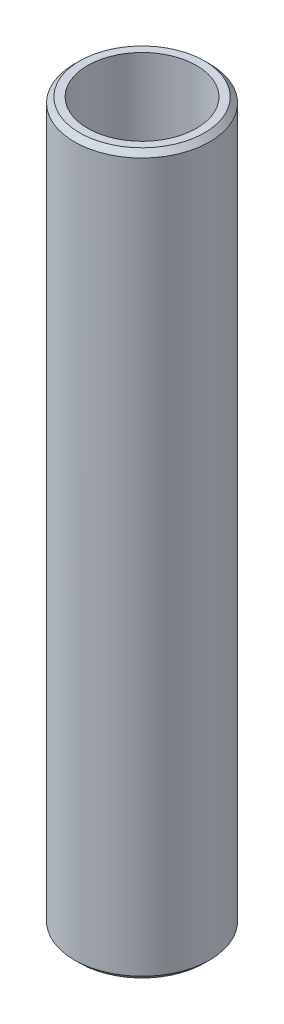
ISO-10303-21;
HEADER;
FILE_DESCRIPTION(('STEP AP214'),'2;1');
FILE_NAME('part.step','',(''),(''),'','','');
FILE_SCHEMA(('AUTOMOTIVE_DESIGN { 1 0 10303 214 1 1 1 1 }'));
ENDSEC;
DATA;
#1=APPLICATION_CONTEXT('core data for automotive mechanical design processes');
#2=APPLICATION_PROTOCOL_DEFINITION('international standard','automotive_design',2000,#1);
#3=PRODUCT_CONTEXT('',#1,'mechanical');
#4=PRODUCT('Part','Part','',(#3));
#5=PRODUCT_RELATED_PRODUCT_CATEGORY('part','',(#4));
#6=PRODUCT_DEFINITION_FORMATION('','',#4);
#7=PRODUCT_DEFINITION_CONTEXT('part definition',#1,'design');
#8=PRODUCT_DEFINITION('design','',#6,#7);
#9=PRODUCT_DEFINITION_SHAPE('','',#8);
#10=(LENGTH_UNIT() NAMED_UNIT(*) SI_UNIT(.MILLI.,.METRE.));
#11=(NAMED_UNIT(*) PLANE_ANGLE_UNIT() SI_UNIT($,.RADIAN.));
#12=(NAMED_UNIT(*) SI_UNIT($,.STERADIAN.) SOLID_ANGLE_UNIT());
#13=UNCERTAINTY_MEASURE_WITH_UNIT(LENGTH_MEASURE(1.E-05),#10,'distance_accuracy_value','');
#14=(GEOMETRIC_REPRESENTATION_CONTEXT(3) GLOBAL_UNCERTAINTY_ASSIGNED_CONTEXT((#13)) GLOBAL_UNIT_ASSIGNED_CONTEXT((#10,
#11,#12)) REPRESENTATION_CONTEXT('',''));
#15=CARTESIAN_POINT('',(0.,0.,0.));
#16=DIRECTION('',(0.,0.,1.));
#17=DIRECTION('',(1.,0.,0.));
#18=AXIS2_PLACEMENT_3D('',#15,#16,#17);
#19=CARTESIAN_POINT('',(0.,345.746391025883,0.));
#20=DIRECTION('',(0.,-1.,0.));
#21=DIRECTION('',(0.,0.,-1.));
#22=AXIS2_PLACEMENT_3D('',#19,#20,#21);
#23=CYLINDRICAL_SURFACE('',#22,32.5);
#24=CARTESIAN_POINT('',(0.,343.246958026156,0.));
#25=DIRECTION('',(0.,1.,0.));
#26=DIRECTION('',(0.,0.,1.));
#27=AXIS2_PLACEMENT_3D('',#24,#25,#26);
#28=CIRCLE('',#27,32.5);
#29=CARTESIAN_POINT('',(0.,343.246958026156,-32.5));
#30=VERTEX_POINT('',#29);
#31=EDGE_CURVE('E50',#30,#30,#28,.F.);
#32=CARTESIAN_POINT('',(0.,2.49943299972771,0.));
#33=DIRECTION('',(0.,1.,0.));
#34=DIRECTION('',(0.,0.,1.));
#35=AXIS2_PLACEMENT_3D('',#32,#33,#34);
#36=CIRCLE('',#35,32.5);
#37=CARTESIAN_POINT('',(0.,2.49943299972766,-32.5));
#38=VERTEX_POINT('',#37);
#39=EDGE_CURVE('E51',#38,#38,#36,.T.);
#40=CARTESIAN_POINT('',(0.,343.246958026156,-32.5));
#41=CARTESIAN_POINT('',(0.,339.697504640464,-32.5));
#42=CARTESIAN_POINT('',(0.,336.148051254772,-32.5));
#43=CARTESIAN_POINT('',(0.,329.049144483388,-32.5));
#44=CARTESIAN_POINT('',(0.,325.499691097696,-32.5));
#45=CARTESIAN_POINT('',(0.,318.400784326312,-32.5));
#46=CARTESIAN_POINT('',(0.,314.85133094062,-32.5));
#47=CARTESIAN_POINT('',(0.,307.752424169236,-32.5));
#48=CARTESIAN_POINT('',(0.,304.202970783544,-32.5));
#49=CARTESIAN_POINT('',(0.,297.10406401216,-32.5));
#50=CARTESIAN_POINT('',(0.,293.554610626468,-32.5));
#51=CARTESIAN_POINT('',(0.,286.455703855084,-32.5));
#52=CARTESIAN_POINT('',(0.,282.906250469392,-32.5));
#53=CARTESIAN_POINT('',(0.,275.807343698008,-32.5));
#54=CARTESIAN_POINT('',(0.,272.257890312316,-32.5));
#55=CARTESIAN_POINT('',(0.,265.158983540932,-32.5));
#56=CARTESIAN_POINT('',(0.,261.609530155241,-32.5));
#57=CARTESIAN_POINT('',(0.,254.510623383857,-32.5));
#58=CARTESIAN_POINT('',(0.,250.961169998165,-32.5));
#59=CARTESIAN_POINT('',(0.,243.862263226781,-32.5));
#60=CARTESIAN_POINT('',(0.,240.312809841089,-32.5));
#61=CARTESIAN_POINT('',(0.,233.213903069705,-32.5));
#62=CARTESIAN_POINT('',(0.,229.664449684013,-32.5));
#63=CARTESIAN_POINT('',(0.,222.565542912629,-32.5));
#64=CARTESIAN_POINT('',(0.,219.016089526937,-32.5));
#65=CARTESIAN_POINT('',(0.,211.917182755553,-32.5));
#66=CARTESIAN_POINT('',(0.,208.367729369861,-32.5));
#67=CARTESIAN_POINT('',(0.,201.268822598477,-32.5));
#68=CARTESIAN_POINT('',(0.,197.719369212785,-32.5));
#69=CARTESIAN_POINT('',(0.,190.620462441401,-32.5));
#70=CARTESIAN_POINT('',(0.,187.071009055709,-32.5));
#71=CARTESIAN_POINT('',(0.,179.972102284326,-32.5));
#72=CARTESIAN_POINT('',(0.,176.422648898634,-32.5));
#73=CARTESIAN_POINT('',(0.,169.32374212725,-32.5));
#74=CARTESIAN_POINT('',(0.,165.774288741558,-32.5));
#75=CARTESIAN_POINT('',(0.,158.675381970174,-32.5));
#76=CARTESIAN_POINT('',(0.,155.125928584482,-32.5));
#77=CARTESIAN_POINT('',(0.,148.027021813098,-32.5));
#78=CARTESIAN_POINT('',(0.,144.477568427406,-32.5));
#79=CARTESIAN_POINT('',(0.,137.378661656022,-32.5));
#80=CARTESIAN_POINT('',(0.,133.82920827033,-32.5));
#81=CARTESIAN_POINT('',(0.,126.730301498946,-32.5));
#82=CARTESIAN_POINT('',(0.,123.180848113254,-32.5));
#83=CARTESIAN_POINT('',(0.,116.08194134187,-32.5));
#84=CARTESIAN_POINT('',(0.,112.532487956178,-32.5));
#85=CARTESIAN_POINT('',(0.,105.433581184794,-32.5));
#86=CARTESIAN_POINT('',(0.,101.884127799102,-32.5));
#87=CARTESIAN_POINT('',(0.,94.7852210277186,-32.5));
#88=CARTESIAN_POINT('',(0.,91.2357676420266,-32.5));
#89=CARTESIAN_POINT('',(0.,84.1368608706427,-32.5));
#90=CARTESIAN_POINT('',(0.,80.5874074849507,-32.5));
#91=CARTESIAN_POINT('',(0.,73.4885007135668,-32.5));
#92=CARTESIAN_POINT('',(0.,69.9390473278749,-32.5));
#93=CARTESIAN_POINT('',(0.,62.840140556491,-32.5));
#94=CARTESIAN_POINT('',(0.,59.290687170799,-32.5));
#95=CARTESIAN_POINT('',(0.,52.1917803994151,-32.5));
#96=CARTESIAN_POINT('',(0.,48.6423270137231,-32.5));
#97=CARTESIAN_POINT('',(0.,41.5434202423392,-32.5));
#98=CARTESIAN_POINT('',(0.,37.9939668566472,-32.5));
#99=CARTESIAN_POINT('',(0.,30.8950600852633,-32.5));
#100=CARTESIAN_POINT('',(0.,27.3456066995714,-32.5));
#101=CARTESIAN_POINT('',(0.,20.2466999281875,-32.5));
#102=CARTESIAN_POINT('',(0.,16.6972465424955,-32.5));
#103=CARTESIAN_POINT('',(0.,9.59833977111158,-32.5));
#104=CARTESIAN_POINT('',(0.,6.04888638541962,-32.5));
#105=CARTESIAN_POINT('',(0.,2.49943299972766,-32.5));
#106=B_SPLINE_CURVE_WITH_KNOTS('',3,(#40,#41,#42,#43,#44,#45,#46,#47,#48,#49,#50,#51,#52,#53,
#54,#55,#56,#57,#58,#59,#60,#61,#62,#63,#64,#65,#66,#67,#68,#69,#70,#71,#72,#73,#74,#75,#76,#77,
#78,#79,#80,#81,#82,#83,#84,#85,#86,#87,#88,#89,#90,#91,#92,#93,#94,#95,#96,#97,#98,#99,#100,
#101,#102,#103,#104,#105),.UNSPECIFIED.,.F.,.F.,(4,2,2,2,2,2,2,2,2,2,2,2,2,2,2,2,2,2,2,2,2,2,2,
2,2,2,2,2,2,2,2,2,4),(0.,10.6483601570758,21.2967203141517,31.9450804712276,42.5934406283034,
53.2418007853793,63.8901609424552,74.5385210995311,85.186881256607,95.8352414136828,
106.483601570759,117.131961727835,127.78032188491,138.428682041986,149.077042199062,
159.725402356138,170.373762513214,181.02212267029,191.670482827366,202.318842984442,
212.967203141517,223.615563298593,234.263923455669,244.912283612745,255.560643769821,
266.209003926897,276.857364083973,287.505724241048,298.154084398124,308.8024445552,
319.450804712276,330.099164869352,340.747525026428),.UNSPECIFIED.);
#107=EDGE_CURVE('BSEAM39',#30,#38,#106,.T.);
#108=ORIENTED_EDGE('',*,*,#31,.T.);
#109=ORIENTED_EDGE('',*,*,#39,.T.);
#110=ORIENTED_EDGE('',*,*,#107,.T.);
#111=ORIENTED_EDGE('',*,*,#107,.F.);
#112=EDGE_LOOP('',(#108,#110,#109,#111));
#113=FACE_BOUND('',#112,.T.);
#114=ADVANCED_FACE('F39',(#113),#23,.T.);
#115=CARTESIAN_POINT('',(0.,345.746391025883,0.));
#116=DIRECTION('',(0.,1.,0.));
#117=DIRECTION('',(0.,0.,1.));
#118=AXIS2_PLACEMENT_3D('',#115,#116,#117);
#119=PLANE('',#118);
#120=CARTESIAN_POINT('',(0.,345.746391025883,0.));
#121=DIRECTION('',(0.,1.,0.));
#122=DIRECTION('',(0.,0.,1.));
#123=AXIS2_PLACEMENT_3D('',#120,#121,#122);
#124=CIRCLE('',#123,30.0005670002728);
#125=CARTESIAN_POINT('',(0.,345.746391025883,-30.0005670002728));
#126=VERTEX_POINT('',#125);
#127=EDGE_CURVE('E54',#126,#126,#124,.T.);
#128=ORIENTED_EDGE('',*,*,#127,.T.);
#129=EDGE_LOOP('',(#128));
#130=FACE_BOUND('',#129,.T.);
#131=CARTESIAN_POINT('',(0.,345.746391025883,0.));
#132=DIRECTION('',(0.,1.,0.));
#133=DIRECTION('',(0.,0.,1.));
#134=AXIS2_PLACEMENT_3D('',#131,#132,#133);
#135=CIRCLE('',#134,26.1776362664108);
#136=CARTESIAN_POINT('',(0.,345.746391025883,-26.1776362664108));
#137=VERTEX_POINT('',#136);
#138=EDGE_CURVE('E58',#137,#137,#135,.T.);
#139=ORIENTED_EDGE('',*,*,#138,.F.);
#140=EDGE_LOOP('',(#139));
#141=FACE_BOUND('',#140,.T.);
#142=ADVANCED_FACE('F69',(#130,#141),#119,.T.);
#143=CARTESIAN_POINT('',(0.,0.,0.));
#144=DIRECTION('',(0.,1.,0.));
#145=DIRECTION('',(0.,0.,1.));
#146=AXIS2_PLACEMENT_3D('',#143,#144,#145);
#147=PLANE('',#146);
#148=CARTESIAN_POINT('',(0.,0.,0.));
#149=DIRECTION('',(0.,1.,0.));
#150=DIRECTION('',(0.,0.,1.));
#151=AXIS2_PLACEMENT_3D('',#148,#149,#150);
#152=CIRCLE('',#151,30.0005670002723);
#153=CARTESIAN_POINT('',(0.,0.,30.0005670002723));
#154=VERTEX_POINT('',#153);
#155=EDGE_CURVE('E10',#154,#154,#152,.F.);
#156=ORIENTED_EDGE('',*,*,#155,.T.);
#157=EDGE_LOOP('',(#156));
#158=FACE_BOUND('',#157,.T.);
#159=CARTESIAN_POINT('',(0.,0.,0.));
#160=DIRECTION('',(0.,1.,0.));
#161=DIRECTION('',(0.,0.,1.));
#162=AXIS2_PLACEMENT_3D('',#159,#160,#161);
#163=CIRCLE('',#162,26.1776362664108);
#164=CARTESIAN_POINT('',(0.,0.,-26.1776362664108));
#165=VERTEX_POINT('',#164);
#166=EDGE_CURVE('E63',#165,#165,#163,.T.);
#167=ORIENTED_EDGE('',*,*,#166,.T.);
#168=EDGE_LOOP('',(#167));
#169=FACE_BOUND('',#168,.T.);
#170=ADVANCED_FACE('F75',(#158,#169),#147,.F.);
#171=CARTESIAN_POINT('',(0.,345.746391025883,0.));
#172=DIRECTION('',(0.,-1.,0.));
#173=DIRECTION('',(0.,0.,-1.));
#174=AXIS2_PLACEMENT_3D('',#171,#172,#173);
#175=CYLINDRICAL_SURFACE('',#174,26.1776362664108);
#176=CARTESIAN_POINT('',(0.,345.746391025883,-26.1776362664108));
#177=CARTESIAN_POINT('',(0.,342.144866119363,-26.1776362664108));
#178=CARTESIAN_POINT('',(0.,338.543341212844,-26.1776362664108));
#179=CARTESIAN_POINT('',(0.,331.340291399804,-26.1776362664108));
#180=CARTESIAN_POINT('',(0.,327.738766493285,-26.1776362664108));
#181=CARTESIAN_POINT('',(0.,320.535716680246,-26.1776362664108));
#182=CARTESIAN_POINT('',(0.,316.934191773726,-26.1776362664108));
#183=CARTESIAN_POINT('',(0.,309.731141960687,-26.1776362664108));
#184=CARTESIAN_POINT('',(0.,306.129617054167,-26.1776362664108));
#185=CARTESIAN_POINT('',(0.,298.926567241128,-26.1776362664108));
#186=CARTESIAN_POINT('',(0.,295.325042334608,-26.1776362664108));
#187=CARTESIAN_POINT('',(0.,288.121992521569,-26.1776362664108));
#188=CARTESIAN_POINT('',(0.,284.520467615049,-26.1776362664108));
#189=CARTESIAN_POINT('',(0.,277.31741780201,-26.1776362664108));
#190=CARTESIAN_POINT('',(0.,273.715892895491,-26.1776362664108));
#191=CARTESIAN_POINT('',(0.,266.512843082451,-26.1776362664108));
#192=CARTESIAN_POINT('',(0.,262.911318175932,-26.1776362664108));
#193=CARTESIAN_POINT('',(0.,255.708268362893,-26.1776362664108));
#194=CARTESIAN_POINT('',(0.,252.106743456373,-26.1776362664108));
#195=CARTESIAN_POINT('',(0.,244.903693643334,-26.1776362664108));
#196=CARTESIAN_POINT('',(0.,241.302168736814,-26.1776362664108));
#197=CARTESIAN_POINT('',(0.,234.099118923775,-26.1776362664108));
#198=CARTESIAN_POINT('',(0.,230.497594017255,-26.1776362664108));
#199=CARTESIAN_POINT('',(0.,223.294544204216,-26.1776362664108));
#200=CARTESIAN_POINT('',(0.,219.693019297696,-26.1776362664108));
#201=CARTESIAN_POINT('',(0.,212.489969484657,-26.1776362664108));
#202=CARTESIAN_POINT('',(0.,208.888444578138,-26.1776362664108));
#203=CARTESIAN_POINT('',(0.,201.685394765098,-26.1776362664108));
#204=CARTESIAN_POINT('',(0.,198.083869858579,-26.1776362664108));
#205=CARTESIAN_POINT('',(0.,190.880820045539,-26.1776362664108));
#206=CARTESIAN_POINT('',(0.,187.27929513902,-26.1776362664108));
#207=CARTESIAN_POINT('',(0.,180.076245325981,-26.1776362664108));
#208=CARTESIAN_POINT('',(0.,176.474720419461,-26.1776362664108));
#209=CARTESIAN_POINT('',(0.,169.271670606422,-26.1776362664108));
#210=CARTESIAN_POINT('',(0.,165.670145699902,-26.1776362664108));
#211=CARTESIAN_POINT('',(0.,158.467095886863,-26.1776362664108));
#212=CARTESIAN_POINT('',(0.,154.865570980343,-26.1776362664108));
#213=CARTESIAN_POINT('',(0.,147.662521167304,-26.1776362664108));
#214=CARTESIAN_POINT('',(0.,144.060996260784,-26.1776362664108));
#215=CARTESIAN_POINT('',(0.,136.857946447745,-26.1776362664108));
#216=CARTESIAN_POINT('',(0.,133.256421541226,-26.1776362664108));
#217=CARTESIAN_POINT('',(0.,126.053371728186,-26.1776362664108));
#218=CARTESIAN_POINT('',(0.,122.451846821667,-26.1776362664108));
#219=CARTESIAN_POINT('',(0.,115.248797008628,-26.1776362664108));
#220=CARTESIAN_POINT('',(0.,111.647272102108,-26.1776362664108));
#221=CARTESIAN_POINT('',(0.,104.444222289069,-26.1776362664108));
#222=CARTESIAN_POINT('',(0.,100.842697382549,-26.1776362664108));
#223=CARTESIAN_POINT('',(0.,93.6396475695099,-26.1776362664108));
#224=CARTESIAN_POINT('',(0.,90.0381226629903,-26.1776362664108));
#225=CARTESIAN_POINT('',(0.,82.8350728499511,-26.1776362664108));
#226=CARTESIAN_POINT('',(0.,79.2335479434315,-26.1776362664108));
#227=CARTESIAN_POINT('',(0.,72.0304981303922,-26.1776362664108));
#228=CARTESIAN_POINT('',(0.,68.4289732238726,-26.1776362664108));
#229=CARTESIAN_POINT('',(0.,61.2259234108334,-26.1776362664108));
#230=CARTESIAN_POINT('',(0.,57.6243985043138,-26.1776362664108));
#231=CARTESIAN_POINT('',(0.,50.4213486912746,-26.1776362664108));
#232=CARTESIAN_POINT('',(0.,46.819823784755,-26.1776362664108));
#233=CARTESIAN_POINT('',(0.,39.6167739717157,-26.1776362664108));
#234=CARTESIAN_POINT('',(0.,36.0152490651961,-26.1776362664108));
#235=CARTESIAN_POINT('',(0.,28.8121992521569,-26.1776362664108));
#236=CARTESIAN_POINT('',(0.,25.2106743456373,-26.1776362664108));
#237=CARTESIAN_POINT('',(0.,18.0076245325981,-26.1776362664108));
#238=CARTESIAN_POINT('',(0.,14.4060996260785,-26.1776362664108));
#239=CARTESIAN_POINT('',(0.,7.20304981303924,-26.1776362664108));
#240=CARTESIAN_POINT('',(0.,3.60152490651962,-26.1776362664108));
#241=CARTESIAN_POINT('',(0.,0.,-26.1776362664108));
#242=B_SPLINE_CURVE_WITH_KNOTS('',3,(#176,#177,#178,#179,#180,#181,#182,#183,#184,#185,#186,
#187,#188,#189,#190,#191,#192,#193,#194,#195,#196,#197,#198,#199,#200,#201,#202,#203,#204,#205,
#206,#207,#208,#209,#210,#211,#212,#213,#214,#215,#216,#217,#218,#219,#220,#221,#222,#223,#224,
#225,#226,#227,#228,#229,#230,#231,#232,#233,#234,#235,#236,#237,#238,#239,#240,#241),
.UNSPECIFIED.,.F.,.F.,(4,2,2,2,2,2,2,2,2,2,2,2,2,2,2,2,2,2,2,2,2,2,2,2,2,2,2,2,2,2,2,2,4),(0.,
10.8045747195589,21.6091494391177,32.4137241586766,43.2182988782354,54.0228735977942,
64.827448317353,75.6320230369119,86.4365977564707,97.2411724760296,108.045747195588,
118.850321915147,129.654896634706,140.459471354265,151.264046073824,162.068620793383,
172.873195512941,183.6777702325,194.482344952059,205.286919671618,216.091494391177,
226.896069110736,237.700643830294,248.505218549853,259.309793269412,270.114367988971,
280.91894270853,291.723517428089,302.528092147647,313.332666867206,324.137241586765,
334.941816306324,345.746391025883),.UNSPECIFIED.);
#243=EDGE_CURVE('BSEAM70',#137,#165,#242,.T.);
#244=ORIENTED_EDGE('',*,*,#138,.T.);
#245=ORIENTED_EDGE('',*,*,#166,.F.);
#246=ORIENTED_EDGE('',*,*,#243,.T.);
#247=ORIENTED_EDGE('',*,*,#243,.F.);
#248=EDGE_LOOP('',(#244,#246,#245,#247));
#249=FACE_BOUND('',#248,.T.);
#250=ADVANCED_FACE('F70',(#249),#175,.F.);
#251=CARTESIAN_POINT('',(0.,345.746391025883,0.));
#252=DIRECTION('',(0.,-1.,0.));
#253=DIRECTION('',(0.,0.,-1.));
#254=AXIS2_PLACEMENT_3D('',#251,#252,#253);
#255=CONICAL_SURFACE('',#254,30.0005670002728,0.785398163397444);
#256=CARTESIAN_POINT('',(0.,343.246958026156,-32.5));
#257=CARTESIAN_POINT('',(0.,343.272993786569,-32.4739642395862));
#258=CARTESIAN_POINT('',(0.,343.299029546983,-32.4479284791724));
#259=CARTESIAN_POINT('',(0.,343.351101067811,-32.3958569583447));
#260=CARTESIAN_POINT('',(0.,343.377136828225,-32.3698211979309));
#261=CARTESIAN_POINT('',(0.,343.429208349052,-32.3177496771033));
#262=CARTESIAN_POINT('',(0.,343.455244109466,-32.2917139166894));
#263=CARTESIAN_POINT('',(0.,343.507315630294,-32.2396423958618));
#264=CARTESIAN_POINT('',(0.,343.533351390708,-32.213606635448));
#265=CARTESIAN_POINT('',(0.,343.585422911535,-32.1615351146203));
#266=CARTESIAN_POINT('',(0.,343.611458671949,-32.1354993542065));
#267=CARTESIAN_POINT('',(0.,343.663530192777,-32.0834278333788));
#268=CARTESIAN_POINT('',(0.,343.689565953191,-32.057392072965));
#269=CARTESIAN_POINT('',(0.,343.741637474018,-32.0053205521373));
#270=CARTESIAN_POINT('',(0.,343.767673234432,-31.9792847917235));
#271=CARTESIAN_POINT('',(0.,343.81974475526,-31.9272132708959));
#272=CARTESIAN_POINT('',(0.,343.845780515674,-31.9011775104821));
#273=CARTESIAN_POINT('',(0.,343.897852036501,-31.8491059896544));
#274=CARTESIAN_POINT('',(0.,343.923887796915,-31.8230702292406));
#275=CARTESIAN_POINT('',(0.,343.975959317743,-31.7709987084129));
#276=CARTESIAN_POINT('',(0.,344.001995078156,-31.7449629479991));
#277=CARTESIAN_POINT('',(0.,344.054066598984,-31.6928914271714));
#278=CARTESIAN_POINT('',(0.,344.080102359398,-31.6668556667576));
#279=CARTESIAN_POINT('',(0.,344.132173880226,-31.61478414593));
#280=CARTESIAN_POINT('',(0.,344.158209640639,-31.5887483855161));
#281=CARTESIAN_POINT('',(0.,344.210281161467,-31.5366768646885));
#282=CARTESIAN_POINT('',(0.,344.236316921881,-31.5106411042747));
#283=CARTESIAN_POINT('',(0.,344.288388442709,-31.458569583447));
#284=CARTESIAN_POINT('',(0.,344.314424203122,-31.4325338230332));
#285=CARTESIAN_POINT('',(0.,344.36649572395,-31.3804623022055));
#286=CARTESIAN_POINT('',(0.,344.392531484364,-31.3544265417917));
#287=CARTESIAN_POINT('',(0.,344.444603005192,-31.3023550209641));
#288=CARTESIAN_POINT('',(0.,344.470638765605,-31.2763192605502));
#289=CARTESIAN_POINT('',(0.,344.522710286433,-31.2242477397226));
#290=CARTESIAN_POINT('',(0.,344.548746046847,-31.1982119793088));
#291=CARTESIAN_POINT('',(0.,344.600817567674,-31.1461404584811));
#292=CARTESIAN_POINT('',(0.,344.626853328088,-31.1201046980673));
#293=CARTESIAN_POINT('',(0.,344.678924848916,-31.0680331772396));
#294=CARTESIAN_POINT('',(0.,344.70496060933,-31.0419974168258));
#295=CARTESIAN_POINT('',(0.,344.757032130157,-30.9899258959981));
#296=CARTESIAN_POINT('',(0.,344.783067890571,-30.9638901355843));
#297=CARTESIAN_POINT('',(0.,344.835139411399,-30.9118186147567));
#298=CARTESIAN_POINT('',(0.,344.861175171813,-30.8857828543428));
#299=CARTESIAN_POINT('',(0.,344.91324669264,-30.8337113335152));
#300=CARTESIAN_POINT('',(0.,344.939282453054,-30.8076755731014));
#301=CARTESIAN_POINT('',(0.,344.991353973882,-30.7556040522737));
#302=CARTESIAN_POINT('',(0.,345.017389734296,-30.7295682918599));
#303=CARTESIAN_POINT('',(0.,345.069461255123,-30.6774967710322));
#304=CARTESIAN_POINT('',(0.,345.095497015537,-30.6514610106184));
#305=CARTESIAN_POINT('',(0.,345.147568536365,-30.5993894897908));
#306=CARTESIAN_POINT('',(0.,345.173604296779,-30.5733537293769));
#307=CARTESIAN_POINT('',(0.,345.225675817606,-30.5212822085493));
#308=CARTESIAN_POINT('',(0.,345.25171157802,-30.4952464481355));
#309=CARTESIAN_POINT('',(0.,345.303783098848,-30.4431749273078));
#310=CARTESIAN_POINT('',(0.,345.329818859262,-30.417139166894));
#311=CARTESIAN_POINT('',(0.,345.381890380089,-30.3650676460663));
#312=CARTESIAN_POINT('',(0.,345.407926140503,-30.3390318856525));
#313=CARTESIAN_POINT('',(0.,345.459997661331,-30.2869603648249));
#314=CARTESIAN_POINT('',(0.,345.486033421745,-30.260924604411));
#315=CARTESIAN_POINT('',(0.,345.538104942572,-30.2088530835834));
#316=CARTESIAN_POINT('',(0.,345.564140702986,-30.1828173231696));
#317=CARTESIAN_POINT('',(0.,345.616212223814,-30.1307458023419));
#318=CARTESIAN_POINT('',(0.,345.642247984227,-30.1047100419281));
#319=CARTESIAN_POINT('',(0.,345.694319505055,-30.0526385211004));
#320=CARTESIAN_POINT('',(0.,345.720355265469,-30.0266027606866));
#321=CARTESIAN_POINT('',(0.,345.746391025883,-30.0005670002728));
#322=B_SPLINE_CURVE_WITH_KNOTS('',3,(#256,#257,#258,#259,#260,#261,#262,#263,#264,#265,#266,
#267,#268,#269,#270,#271,#272,#273,#274,#275,#276,#277,#278,#279,#280,#281,#282,#283,#284,#285,
#286,#287,#288,#289,#290,#291,#292,#293,#294,#295,#296,#297,#298,#299,#300,#301,#302,#303,#304,
#305,#306,#307,#308,#309,#310,#311,#312,#313,#314,#315,#316,#317,#318,#319,#320,#321),
.UNSPECIFIED.,.F.,.F.,(4,2,2,2,2,2,2,2,2,2,2,2,2,2,2,2,2,2,2,2,2,2,2,2,2,2,2,2,2,2,2,2,4),(0.,
0.110460376451819,0.220920752903598,0.331381129355377,0.441841505807156,0.552301882258941,
0.66276225871072,0.773222635162538,0.883683011614318,0.994143388066097,1.10460376451788,
1.21506414096966,1.32552451742144,1.43598489387326,1.54644527032504,1.65690564677682,
1.7673660232286,1.87782639968038,1.98828677613216,2.09874715258394,2.20920752903576,
2.31966790548754,2.43012828193932,2.5405886583911,2.65104903484288,2.76150941129466,
2.87196978774648,2.98243016419826,3.09289054065004,3.20335091710182,3.3138112935536,
3.42427167000538,3.5347320464572),.UNSPECIFIED.);
#323=EDGE_CURVE('BSEAM81',#30,#126,#322,.T.);
#324=ORIENTED_EDGE('',*,*,#31,.F.);
#325=ORIENTED_EDGE('',*,*,#127,.F.);
#326=ORIENTED_EDGE('',*,*,#323,.T.);
#327=ORIENTED_EDGE('',*,*,#323,.F.);
#328=EDGE_LOOP('',(#324,#326,#325,#327));
#329=FACE_BOUND('',#328,.T.);
#330=ADVANCED_FACE('F81',(#329),#255,.T.);
#331=CARTESIAN_POINT('',(0.,2.49943299972771,0.));
#332=DIRECTION('',(0.,1.,0.));
#333=DIRECTION('',(0.,0.,1.));
#334=AXIS2_PLACEMENT_3D('',#331,#332,#333);
#335=CONICAL_SURFACE('',#334,32.5,0.785398163397448);
#336=ORIENTED_EDGE('',*,*,#155,.F.);
#337=EDGE_LOOP('',(#336));
#338=FACE_BOUND('',#337,.T.);
#339=ORIENTED_EDGE('',*,*,#39,.F.);
#340=EDGE_LOOP('',(#339));
#341=FACE_BOUND('',#340,.T.);
#342=ADVANCED_FACE('F45',(#338,#341),#335,.T.);
#343=CLOSED_SHELL('',(#114,#142,#170,#250,#330,#342));
#344=MANIFOLD_SOLID_BREP('B2',#343);
#345=ADVANCED_BREP_SHAPE_REPRESENTATION('',(#18,#344),#14);
#346=SHAPE_DEFINITION_REPRESENTATION(#9,#345);
ENDSEC;
END-ISO-10303-21;
